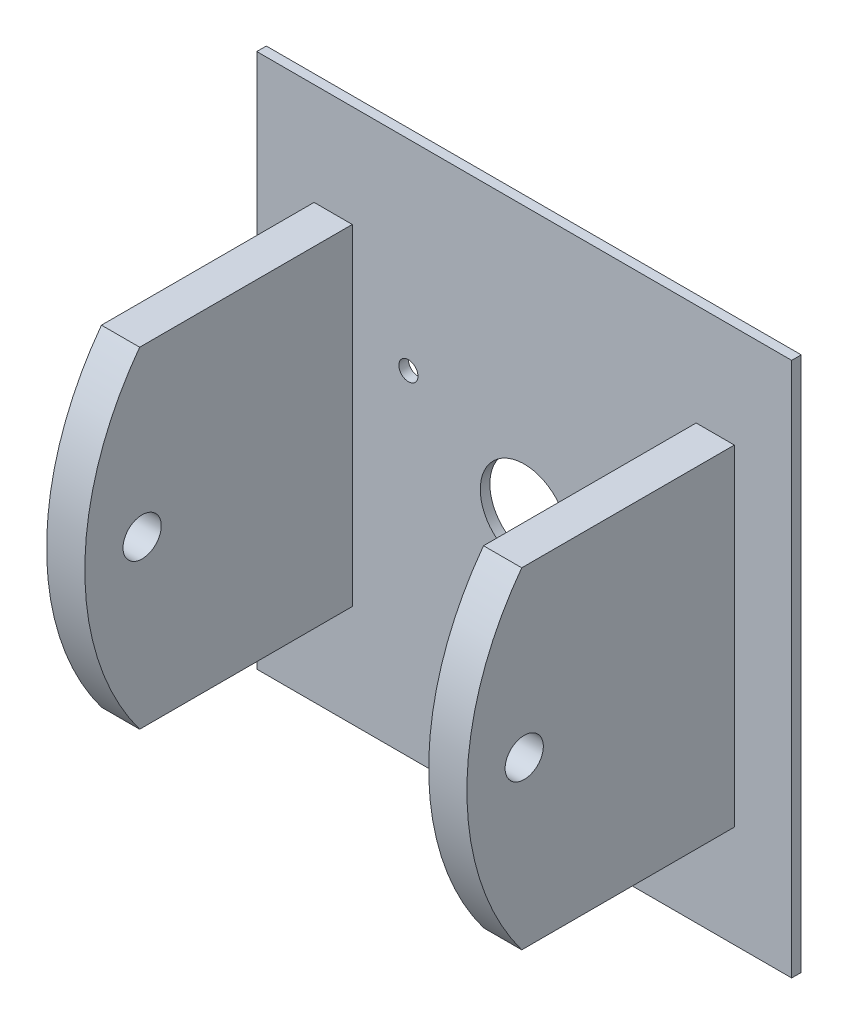
ISO-10303-21;
HEADER;
FILE_DESCRIPTION(('STEP AP214'),'2;1');
FILE_NAME('part.step','',(''),(''),'','','');
FILE_SCHEMA(('AUTOMOTIVE_DESIGN { 1 0 10303 214 1 1 1 1 }'));
ENDSEC;
DATA;
#1=APPLICATION_CONTEXT('core data for automotive mechanical design processes');
#2=APPLICATION_PROTOCOL_DEFINITION('international standard','automotive_design',2000,#1);
#3=PRODUCT_CONTEXT('',#1,'mechanical');
#4=PRODUCT('Part','Part','',(#3));
#5=PRODUCT_RELATED_PRODUCT_CATEGORY('part','',(#4));
#6=PRODUCT_DEFINITION_FORMATION('','',#4);
#7=PRODUCT_DEFINITION_CONTEXT('part definition',#1,'design');
#8=PRODUCT_DEFINITION('design','',#6,#7);
#9=PRODUCT_DEFINITION_SHAPE('','',#8);
#10=(LENGTH_UNIT() NAMED_UNIT(*) SI_UNIT(.MILLI.,.METRE.));
#11=(NAMED_UNIT(*) PLANE_ANGLE_UNIT() SI_UNIT($,.RADIAN.));
#12=(NAMED_UNIT(*) SI_UNIT($,.STERADIAN.) SOLID_ANGLE_UNIT());
#13=UNCERTAINTY_MEASURE_WITH_UNIT(LENGTH_MEASURE(1.E-05),#10,'distance_accuracy_value','');
#14=(GEOMETRIC_REPRESENTATION_CONTEXT(3) GLOBAL_UNCERTAINTY_ASSIGNED_CONTEXT((#13)) GLOBAL_UNIT_ASSIGNED_CONTEXT((#10,
#11,#12)) REPRESENTATION_CONTEXT('',''));
#15=CARTESIAN_POINT('',(0.,0.,0.));
#16=DIRECTION('',(0.,0.,1.));
#17=DIRECTION('',(1.,0.,0.));
#18=AXIS2_PLACEMENT_3D('',#15,#16,#17);
#19=CARTESIAN_POINT('',(-69.85,0.,92.075));
#20=DIRECTION('',(1.,0.,0.));
#21=DIRECTION('',(0.,0.,-1.));
#22=AXIS2_PLACEMENT_3D('',#19,#20,#21);
#23=PLANE('',#22);
#24=CARTESIAN_POINT('',(-69.85,0.,73.025));
#25=DIRECTION('',(-1.,0.,0.));
#26=DIRECTION('',(0.,0.,1.));
#27=AXIS2_PLACEMENT_3D('',#24,#25,#26);
#28=CIRCLE('',#27,6.35);
#29=CARTESIAN_POINT('',(-69.85,0.,79.375));
#30=VERTEX_POINT('',#29);
#31=EDGE_CURVE('E189',#30,#30,#28,.T.);
#32=ORIENTED_EDGE('',*,*,#31,.F.);
#33=EDGE_LOOP('',(#32));
#34=FACE_BOUND('',#33,.T.);
#35=DIRECTION('',(0.,0.,-1.));
#36=VECTOR('',#35,1.);
#37=CARTESIAN_POINT('',(-69.85,-54.9926131403118,92.075));
#38=LINE('',#37,#36);
#39=CARTESIAN_POINT('',(-69.85,-54.9926131403118,73.8486162700426));
#40=VERTEX_POINT('',#39);
#41=CARTESIAN_POINT('',(-69.85,-54.9926131403118,3.175));
#42=VERTEX_POINT('',#41);
#43=EDGE_CURVE('E185',#40,#42,#38,.T.);
#44=ORIENTED_EDGE('',*,*,#43,.F.);
#45=CARTESIAN_POINT('',(-69.85,0.,0.));
#46=DIRECTION('',(-1.,0.,0.));
#47=DIRECTION('',(0.,0.,1.));
#48=AXIS2_PLACEMENT_3D('',#45,#46,#47);
#49=CIRCLE('',#48,92.075);
#50=CARTESIAN_POINT('',(-69.85,54.9926131403118,73.8486162700426));
#51=VERTEX_POINT('',#50);
#52=EDGE_CURVE('E170',#40,#51,#49,.T.);
#53=ORIENTED_EDGE('',*,*,#52,.T.);
#54=DIRECTION('',(0.,0.,-1.));
#55=VECTOR('',#54,1.);
#56=CARTESIAN_POINT('',(-69.85,54.9926131403118,92.075));
#57=LINE('',#56,#55);
#58=CARTESIAN_POINT('',(-69.85,54.9926131403118,3.175));
#59=VERTEX_POINT('',#58);
#60=EDGE_CURVE('E512',#51,#59,#57,.T.);
#61=ORIENTED_EDGE('',*,*,#60,.T.);
#62=DIRECTION('',(0.,-1.,0.));
#63=VECTOR('',#62,1.);
#64=CARTESIAN_POINT('',(-69.85,0.,3.175));
#65=LINE('',#64,#63);
#66=EDGE_CURVE('E193',#59,#42,#65,.T.);
#67=ORIENTED_EDGE('',*,*,#66,.T.);
#68=EDGE_LOOP('',(#44,#53,#61,#67));
#69=FACE_BOUND('',#68,.T.);
#70=ADVANCED_FACE('F77',(#34,#69),#23,.F.);
#71=CARTESIAN_POINT('',(-57.15,0.,92.075));
#72=DIRECTION('',(1.,0.,0.));
#73=DIRECTION('',(0.,0.,-1.));
#74=AXIS2_PLACEMENT_3D('',#71,#72,#73);
#75=PLANE('',#74);
#76=CARTESIAN_POINT('',(-57.15,0.,73.025));
#77=DIRECTION('',(1.,0.,0.));
#78=DIRECTION('',(0.,0.,-1.));
#79=AXIS2_PLACEMENT_3D('',#76,#77,#78);
#80=CIRCLE('',#79,6.35);
#81=CARTESIAN_POINT('',(-57.15,0.,66.675));
#82=VERTEX_POINT('',#81);
#83=EDGE_CURVE('E180',#82,#82,#80,.T.);
#84=ORIENTED_EDGE('',*,*,#83,.F.);
#85=EDGE_LOOP('',(#84));
#86=FACE_BOUND('',#85,.T.);
#87=CARTESIAN_POINT('',(-57.15,0.,0.));
#88=DIRECTION('',(1.,0.,0.));
#89=DIRECTION('',(0.,0.,-1.));
#90=AXIS2_PLACEMENT_3D('',#87,#88,#89);
#91=CIRCLE('',#90,92.075);
#92=CARTESIAN_POINT('',(-57.1499999999999,54.9926131403118,73.8486162700426));
#93=VERTEX_POINT('',#92);
#94=CARTESIAN_POINT('',(-57.1499999999999,-54.9926131403118,73.8486162700426));
#95=VERTEX_POINT('',#94);
#96=EDGE_CURVE('E490',#93,#95,#91,.T.);
#97=ORIENTED_EDGE('',*,*,#96,.T.);
#98=DIRECTION('',(0.,0.,-1.));
#99=VECTOR('',#98,1.);
#100=CARTESIAN_POINT('',(-57.15,-54.9926131403118,92.075));
#101=LINE('',#100,#99);
#102=CARTESIAN_POINT('',(-57.15,-54.9926131403118,3.175));
#103=VERTEX_POINT('',#102);
#104=EDGE_CURVE('E187',#95,#103,#101,.T.);
#105=ORIENTED_EDGE('',*,*,#104,.T.);
#106=DIRECTION('',(0.,-1.,0.));
#107=VECTOR('',#106,1.);
#108=CARTESIAN_POINT('',(-57.15,0.,3.175));
#109=LINE('',#108,#107);
#110=CARTESIAN_POINT('',(-57.15,54.9926131403118,3.175));
#111=VERTEX_POINT('',#110);
#112=EDGE_CURVE('E506',#111,#103,#109,.T.);
#113=ORIENTED_EDGE('',*,*,#112,.F.);
#114=DIRECTION('',(0.,0.,-1.));
#115=VECTOR('',#114,1.);
#116=CARTESIAN_POINT('',(-57.15,54.9926131403118,92.075));
#117=LINE('',#116,#115);
#118=EDGE_CURVE('E199',#93,#111,#117,.T.);
#119=ORIENTED_EDGE('',*,*,#118,.F.);
#120=EDGE_LOOP('',(#97,#105,#113,#119));
#121=FACE_BOUND('',#120,.T.);
#122=ADVANCED_FACE('F278',(#86,#121),#75,.T.);
#123=CARTESIAN_POINT('',(69.85,-54.9926131403118,92.075));
#124=DIRECTION('',(-1.,0.,0.));
#125=DIRECTION('',(0.,0.,1.));
#126=AXIS2_PLACEMENT_3D('',#123,#124,#125);
#127=PLANE('',#126);
#128=CARTESIAN_POINT('',(69.85,0.,73.025));
#129=DIRECTION('',(-1.,0.,0.));
#130=DIRECTION('',(0.,0.,1.));
#131=AXIS2_PLACEMENT_3D('',#128,#129,#130);
#132=CIRCLE('',#131,6.35);
#133=CARTESIAN_POINT('',(69.85,0.,79.375));
#134=VERTEX_POINT('',#133);
#135=EDGE_CURVE('E530',#134,#134,#132,.T.);
#136=ORIENTED_EDGE('',*,*,#135,.T.);
#137=EDGE_LOOP('',(#136));
#138=FACE_BOUND('',#137,.T.);
#139=CARTESIAN_POINT('',(69.85,0.,0.));
#140=DIRECTION('',(-1.,0.,0.));
#141=DIRECTION('',(0.,0.,1.));
#142=AXIS2_PLACEMENT_3D('',#139,#140,#141);
#143=CIRCLE('',#142,92.075);
#144=CARTESIAN_POINT('',(69.85,-54.9926131403118,73.8486162700426));
#145=VERTEX_POINT('',#144);
#146=CARTESIAN_POINT('',(69.85,54.9926131403118,73.8486162700426));
#147=VERTEX_POINT('',#146);
#148=EDGE_CURVE('E484',#145,#147,#143,.T.);
#149=ORIENTED_EDGE('',*,*,#148,.F.);
#150=DIRECTION('',(0.,0.,-1.));
#151=VECTOR('',#150,1.);
#152=CARTESIAN_POINT('',(69.85,-54.9926131403118,92.075));
#153=LINE('',#152,#151);
#154=CARTESIAN_POINT('',(69.85,-54.9926131403118,3.175));
#155=VERTEX_POINT('',#154);
#156=EDGE_CURVE('E93',#145,#155,#153,.T.);
#157=ORIENTED_EDGE('',*,*,#156,.T.);
#158=DIRECTION('',(0.,1.,0.));
#159=VECTOR('',#158,1.);
#160=CARTESIAN_POINT('',(69.85,-54.9926131403118,3.175));
#161=LINE('',#160,#159);
#162=CARTESIAN_POINT('',(69.85,54.9926131403118,3.175));
#163=VERTEX_POINT('',#162);
#164=EDGE_CURVE('E486',#155,#163,#161,.T.);
#165=ORIENTED_EDGE('',*,*,#164,.T.);
#166=DIRECTION('',(0.,0.,-1.));
#167=VECTOR('',#166,1.);
#168=CARTESIAN_POINT('',(69.85,54.9926131403118,92.075));
#169=LINE('',#168,#167);
#170=EDGE_CURVE('E101',#147,#163,#169,.T.);
#171=ORIENTED_EDGE('',*,*,#170,.F.);
#172=EDGE_LOOP('',(#149,#157,#165,#171));
#173=FACE_BOUND('',#172,.T.);
#174=ADVANCED_FACE('F284',(#138,#173),#127,.F.);
#175=CARTESIAN_POINT('',(57.15,-54.9926131403118,92.075));
#176=DIRECTION('',(-1.,0.,0.));
#177=DIRECTION('',(0.,0.,1.));
#178=AXIS2_PLACEMENT_3D('',#175,#176,#177);
#179=PLANE('',#178);
#180=CARTESIAN_POINT('',(57.15,0.,73.025));
#181=DIRECTION('',(-1.,0.,0.));
#182=DIRECTION('',(0.,0.,1.));
#183=AXIS2_PLACEMENT_3D('',#180,#181,#182);
#184=CIRCLE('',#183,6.35);
#185=CARTESIAN_POINT('',(57.15,0.,79.375));
#186=VERTEX_POINT('',#185);
#187=EDGE_CURVE('E81',#186,#186,#184,.T.);
#188=ORIENTED_EDGE('',*,*,#187,.F.);
#189=EDGE_LOOP('',(#188));
#190=FACE_BOUND('',#189,.T.);
#191=DIRECTION('',(0.,0.,-1.));
#192=VECTOR('',#191,1.);
#193=CARTESIAN_POINT('',(57.15,-54.9926131403118,92.075));
#194=LINE('',#193,#192);
#195=CARTESIAN_POINT('',(57.15,-54.9926131403118,73.8486162700426));
#196=VERTEX_POINT('',#195);
#197=CARTESIAN_POINT('',(57.15,-54.9926131403118,3.175));
#198=VERTEX_POINT('',#197);
#199=EDGE_CURVE('E488',#196,#198,#194,.T.);
#200=ORIENTED_EDGE('',*,*,#199,.F.);
#201=CARTESIAN_POINT('',(57.15,0.,0.));
#202=DIRECTION('',(-1.,0.,0.));
#203=DIRECTION('',(0.,0.,1.));
#204=AXIS2_PLACEMENT_3D('',#201,#202,#203);
#205=CIRCLE('',#204,92.075);
#206=CARTESIAN_POINT('',(57.15,54.9926131403118,73.8486162700426));
#207=VERTEX_POINT('',#206);
#208=EDGE_CURVE('E482',#196,#207,#205,.T.);
#209=ORIENTED_EDGE('',*,*,#208,.T.);
#210=DIRECTION('',(0.,0.,-1.));
#211=VECTOR('',#210,1.);
#212=CARTESIAN_POINT('',(57.15,54.9926131403118,92.075));
#213=LINE('',#212,#211);
#214=CARTESIAN_POINT('',(57.15,54.9926131403118,3.175));
#215=VERTEX_POINT('',#214);
#216=EDGE_CURVE('E480',#207,#215,#213,.T.);
#217=ORIENTED_EDGE('',*,*,#216,.T.);
#218=DIRECTION('',(0.,1.,0.));
#219=VECTOR('',#218,1.);
#220=CARTESIAN_POINT('',(57.15,-54.9926131403118,3.175));
#221=LINE('',#220,#219);
#222=EDGE_CURVE('E497',#198,#215,#221,.T.);
#223=ORIENTED_EDGE('',*,*,#222,.F.);
#224=EDGE_LOOP('',(#200,#209,#217,#223));
#225=FACE_BOUND('',#224,.T.);
#226=ADVANCED_FACE('F396',(#190,#225),#179,.T.);
#227=CARTESIAN_POINT('',(0.,-54.9926131403118,92.075));
#228=DIRECTION('',(0.,1.,0.));
#229=DIRECTION('',(0.,0.,1.));
#230=AXIS2_PLACEMENT_3D('',#227,#228,#229);
#231=PLANE('',#230);
#232=DIRECTION('',(-1.,0.,0.));
#233=VECTOR('',#232,1.);
#234=CARTESIAN_POINT('',(88.9,-54.9926131403118,73.8486162700426));
#235=LINE('',#234,#233);
#236=EDGE_CURVE('E173',#95,#40,#235,.T.);
#237=ORIENTED_EDGE('',*,*,#236,.T.);
#238=ORIENTED_EDGE('',*,*,#43,.T.);
#239=DIRECTION('',(1.,0.,0.));
#240=VECTOR('',#239,1.);
#241=CARTESIAN_POINT('',(0.,-54.9926131403118,3.175));
#242=LINE('',#241,#240);
#243=EDGE_CURVE('E504',#42,#103,#242,.T.);
#244=ORIENTED_EDGE('',*,*,#243,.T.);
#245=ORIENTED_EDGE('',*,*,#104,.F.);
#246=EDGE_LOOP('',(#237,#238,#244,#245));
#247=FACE_BOUND('',#246,.T.);
#248=ADVANCED_FACE('F183',(#247),#231,.F.);
#249=CARTESIAN_POINT('',(69.85,-54.9926131403118,92.075));
#250=DIRECTION('',(0.,-1.,0.));
#251=DIRECTION('',(0.,0.,-1.));
#252=AXIS2_PLACEMENT_3D('',#249,#250,#251);
#253=PLANE('',#252);
#254=ORIENTED_EDGE('',*,*,#156,.F.);
#255=EDGE_CURVE('E188',#145,#196,#235,.T.);
#256=ORIENTED_EDGE('',*,*,#255,.T.);
#257=ORIENTED_EDGE('',*,*,#199,.T.);
#258=DIRECTION('',(-1.,0.,0.));
#259=VECTOR('',#258,1.);
#260=CARTESIAN_POINT('',(69.85,-54.9926131403118,3.175));
#261=LINE('',#260,#259);
#262=EDGE_CURVE('E500',#155,#198,#261,.T.);
#263=ORIENTED_EDGE('',*,*,#262,.F.);
#264=EDGE_LOOP('',(#254,#256,#257,#263));
#265=FACE_BOUND('',#264,.T.);
#266=ADVANCED_FACE('F413',(#265),#253,.T.);
#267=CARTESIAN_POINT('',(0.,54.9926131403118,92.075));
#268=DIRECTION('',(0.,1.,0.));
#269=DIRECTION('',(0.,0.,1.));
#270=AXIS2_PLACEMENT_3D('',#267,#268,#269);
#271=PLANE('',#270);
#272=ORIENTED_EDGE('',*,*,#60,.F.);
#273=DIRECTION('',(-1.,0.,0.));
#274=VECTOR('',#273,1.);
#275=CARTESIAN_POINT('',(88.9,54.9926131403118,73.8486162700426));
#276=LINE('',#275,#274);
#277=EDGE_CURVE('E176',#93,#51,#276,.T.);
#278=ORIENTED_EDGE('',*,*,#277,.F.);
#279=ORIENTED_EDGE('',*,*,#118,.T.);
#280=DIRECTION('',(1.,0.,0.));
#281=VECTOR('',#280,1.);
#282=CARTESIAN_POINT('',(0.,54.9926131403118,3.175));
#283=LINE('',#282,#281);
#284=EDGE_CURVE('E509',#59,#111,#283,.T.);
#285=ORIENTED_EDGE('',*,*,#284,.F.);
#286=EDGE_LOOP('',(#272,#278,#279,#285));
#287=FACE_BOUND('',#286,.T.);
#288=ADVANCED_FACE('F420',(#287),#271,.T.);
#289=CARTESIAN_POINT('',(69.85,54.9926131403118,92.075));
#290=DIRECTION('',(0.,-1.,0.));
#291=DIRECTION('',(0.,0.,-1.));
#292=AXIS2_PLACEMENT_3D('',#289,#290,#291);
#293=PLANE('',#292);
#294=EDGE_CURVE('E479',#147,#207,#276,.T.);
#295=ORIENTED_EDGE('',*,*,#294,.F.);
#296=ORIENTED_EDGE('',*,*,#170,.T.);
#297=DIRECTION('',(-1.,0.,0.));
#298=VECTOR('',#297,1.);
#299=CARTESIAN_POINT('',(69.85,54.9926131403118,3.175));
#300=LINE('',#299,#298);
#301=EDGE_CURVE('E495',#163,#215,#300,.T.);
#302=ORIENTED_EDGE('',*,*,#301,.T.);
#303=ORIENTED_EDGE('',*,*,#216,.F.);
#304=EDGE_LOOP('',(#295,#296,#302,#303));
#305=FACE_BOUND('',#304,.T.);
#306=ADVANCED_FACE('F309',(#305),#293,.F.);
#307=CARTESIAN_POINT('',(0.,0.,3.175));
#308=DIRECTION('',(0.,0.,1.));
#309=DIRECTION('',(1.,0.,0.));
#310=AXIS2_PLACEMENT_3D('',#307,#308,#309);
#311=PLANE('',#310);
#312=ORIENTED_EDGE('',*,*,#262,.T.);
#313=ORIENTED_EDGE('',*,*,#222,.T.);
#314=ORIENTED_EDGE('',*,*,#301,.F.);
#315=ORIENTED_EDGE('',*,*,#164,.F.);
#316=EDGE_LOOP('',(#312,#313,#314,#315));
#317=FACE_BOUND('',#316,.T.);
#318=ORIENTED_EDGE('',*,*,#66,.F.);
#319=ORIENTED_EDGE('',*,*,#284,.T.);
#320=ORIENTED_EDGE('',*,*,#112,.T.);
#321=ORIENTED_EDGE('',*,*,#243,.F.);
#322=EDGE_LOOP('',(#318,#319,#320,#321));
#323=FACE_BOUND('',#322,.T.);
#324=CARTESIAN_POINT('',(-38.4948291982183,22.225,3.175));
#325=DIRECTION('',(0.,0.,1.));
#326=DIRECTION('',(1.,0.,0.));
#327=AXIS2_PLACEMENT_3D('',#324,#325,#326);
#328=CIRCLE('',#327,3.175);
#329=CARTESIAN_POINT('',(-35.3198291982183,22.225,3.175));
#330=VERTEX_POINT('',#329);
#331=EDGE_CURVE('E207',#330,#330,#328,.T.);
#332=ORIENTED_EDGE('',*,*,#331,.F.);
#333=EDGE_LOOP('',(#332));
#334=FACE_BOUND('',#333,.T.);
#335=CARTESIAN_POINT('',(38.4948291982183,22.225,3.175));
#336=DIRECTION('',(0.,0.,1.));
#337=DIRECTION('',(1.,0.,0.));
#338=AXIS2_PLACEMENT_3D('',#335,#336,#337);
#339=CIRCLE('',#338,3.175);
#340=CARTESIAN_POINT('',(41.6698291982183,22.225,3.175));
#341=VERTEX_POINT('',#340);
#342=EDGE_CURVE('E213',#341,#341,#339,.T.);
#343=ORIENTED_EDGE('',*,*,#342,.F.);
#344=EDGE_LOOP('',(#343));
#345=FACE_BOUND('',#344,.T.);
#346=CARTESIAN_POINT('',(0.,-44.45,3.175));
#347=DIRECTION('',(0.,0.,1.));
#348=DIRECTION('',(1.,0.,0.));
#349=AXIS2_PLACEMENT_3D('',#346,#347,#348);
#350=CIRCLE('',#349,3.175);
#351=CARTESIAN_POINT('',(3.175,-44.45,3.175));
#352=VERTEX_POINT('',#351);
#353=EDGE_CURVE('E194',#352,#352,#350,.T.);
#354=ORIENTED_EDGE('',*,*,#353,.F.);
#355=EDGE_LOOP('',(#354));
#356=FACE_BOUND('',#355,.T.);
#357=DIRECTION('',(0.,1.,0.));
#358=VECTOR('',#357,1.);
#359=CARTESIAN_POINT('',(88.9,88.9,3.175));
#360=LINE('',#359,#358);
#361=CARTESIAN_POINT('',(88.9,-88.9,3.175));
#362=VERTEX_POINT('',#361);
#363=CARTESIAN_POINT('',(88.9,88.9,3.175));
#364=VERTEX_POINT('',#363);
#365=EDGE_CURVE('E224',#362,#364,#360,.T.);
#366=ORIENTED_EDGE('',*,*,#365,.T.);
#367=DIRECTION('',(-1.,0.,0.));
#368=VECTOR('',#367,1.);
#369=CARTESIAN_POINT('',(-88.9,88.9,3.175));
#370=LINE('',#369,#368);
#371=CARTESIAN_POINT('',(-88.9,88.9,3.175));
#372=VERTEX_POINT('',#371);
#373=EDGE_CURVE('E227',#364,#372,#370,.T.);
#374=ORIENTED_EDGE('',*,*,#373,.T.);
#375=DIRECTION('',(0.,-1.,0.));
#376=VECTOR('',#375,1.);
#377=CARTESIAN_POINT('',(-88.9,88.9,3.175));
#378=LINE('',#377,#376);
#379=CARTESIAN_POINT('',(-88.9,-88.9,3.175));
#380=VERTEX_POINT('',#379);
#381=EDGE_CURVE('E230',#372,#380,#378,.T.);
#382=ORIENTED_EDGE('',*,*,#381,.T.);
#383=DIRECTION('',(1.,0.,0.));
#384=VECTOR('',#383,1.);
#385=CARTESIAN_POINT('',(-88.9,-88.9,3.175));
#386=LINE('',#385,#384);
#387=EDGE_CURVE('E232',#380,#362,#386,.T.);
#388=ORIENTED_EDGE('',*,*,#387,.T.);
#389=EDGE_LOOP('',(#366,#374,#382,#388));
#390=FACE_BOUND('',#389,.T.);
#391=CARTESIAN_POINT('',(0.,0.,3.175));
#392=DIRECTION('',(0.,0.,1.));
#393=DIRECTION('',(1.,0.,0.));
#394=AXIS2_PLACEMENT_3D('',#391,#392,#393);
#395=CIRCLE('',#394,14.605);
#396=CARTESIAN_POINT('',(14.605,0.,3.175));
#397=VERTEX_POINT('',#396);
#398=EDGE_CURVE('E218',#397,#397,#395,.T.);
#399=ORIENTED_EDGE('',*,*,#398,.F.);
#400=EDGE_LOOP('',(#399));
#401=FACE_BOUND('',#400,.T.);
#402=ADVANCED_FACE('F268',(#317,#323,#334,#345,#356,#390,#401),#311,.T.);
#403=CARTESIAN_POINT('',(0.,0.,0.));
#404=DIRECTION('',(0.,0.,1.));
#405=DIRECTION('',(1.,0.,0.));
#406=AXIS2_PLACEMENT_3D('',#403,#404,#405);
#407=PLANE('',#406);
#408=CARTESIAN_POINT('',(-38.4948291982183,22.225,0.));
#409=DIRECTION('',(0.,0.,1.));
#410=DIRECTION('',(1.,0.,0.));
#411=AXIS2_PLACEMENT_3D('',#408,#409,#410);
#412=CIRCLE('',#411,3.175);
#413=CARTESIAN_POINT('',(-35.3198291982183,22.225,0.));
#414=VERTEX_POINT('',#413);
#415=EDGE_CURVE('E203',#414,#414,#412,.T.);
#416=ORIENTED_EDGE('',*,*,#415,.T.);
#417=EDGE_LOOP('',(#416));
#418=FACE_BOUND('',#417,.T.);
#419=CARTESIAN_POINT('',(38.4948291982183,22.225,0.));
#420=DIRECTION('',(0.,0.,1.));
#421=DIRECTION('',(1.,0.,0.));
#422=AXIS2_PLACEMENT_3D('',#419,#420,#421);
#423=CIRCLE('',#422,3.175);
#424=CARTESIAN_POINT('',(41.6698291982183,22.225,0.));
#425=VERTEX_POINT('',#424);
#426=EDGE_CURVE('E210',#425,#425,#423,.T.);
#427=ORIENTED_EDGE('',*,*,#426,.T.);
#428=EDGE_LOOP('',(#427));
#429=FACE_BOUND('',#428,.T.);
#430=CARTESIAN_POINT('',(0.,-44.45,0.));
#431=DIRECTION('',(0.,0.,1.));
#432=DIRECTION('',(1.,0.,0.));
#433=AXIS2_PLACEMENT_3D('',#430,#431,#432);
#434=CIRCLE('',#433,3.175);
#435=CARTESIAN_POINT('',(3.175,-44.45,0.));
#436=VERTEX_POINT('',#435);
#437=EDGE_CURVE('E197',#436,#436,#434,.T.);
#438=ORIENTED_EDGE('',*,*,#437,.T.);
#439=EDGE_LOOP('',(#438));
#440=FACE_BOUND('',#439,.T.);
#441=DIRECTION('',(0.,1.,0.));
#442=VECTOR('',#441,1.);
#443=CARTESIAN_POINT('',(88.9,88.9,0.));
#444=LINE('',#443,#442);
#445=CARTESIAN_POINT('',(88.9,-88.9,0.));
#446=VERTEX_POINT('',#445);
#447=CARTESIAN_POINT('',(88.9,88.9,0.));
#448=VERTEX_POINT('',#447);
#449=EDGE_CURVE('E221',#446,#448,#444,.T.);
#450=ORIENTED_EDGE('',*,*,#449,.F.);
#451=DIRECTION('',(1.,0.,0.));
#452=VECTOR('',#451,1.);
#453=CARTESIAN_POINT('',(-88.9,-88.9,0.));
#454=LINE('',#453,#452);
#455=CARTESIAN_POINT('',(-88.9,-88.9,0.));
#456=VERTEX_POINT('',#455);
#457=EDGE_CURVE('E228',#456,#446,#454,.T.);
#458=ORIENTED_EDGE('',*,*,#457,.F.);
#459=DIRECTION('',(0.,-1.,0.));
#460=VECTOR('',#459,1.);
#461=CARTESIAN_POINT('',(-88.9,88.9,0.));
#462=LINE('',#461,#460);
#463=CARTESIAN_POINT('',(-88.9,88.9,0.));
#464=VERTEX_POINT('',#463);
#465=EDGE_CURVE('E239',#464,#456,#462,.T.);
#466=ORIENTED_EDGE('',*,*,#465,.F.);
#467=DIRECTION('',(-1.,0.,0.));
#468=VECTOR('',#467,1.);
#469=CARTESIAN_POINT('',(-88.9,88.9,0.));
#470=LINE('',#469,#468);
#471=EDGE_CURVE('E237',#448,#464,#470,.T.);
#472=ORIENTED_EDGE('',*,*,#471,.F.);
#473=EDGE_LOOP('',(#450,#458,#466,#472));
#474=FACE_BOUND('',#473,.T.);
#475=CARTESIAN_POINT('',(0.,0.,0.));
#476=DIRECTION('',(0.,0.,1.));
#477=DIRECTION('',(1.,0.,0.));
#478=AXIS2_PLACEMENT_3D('',#475,#476,#477);
#479=CIRCLE('',#478,14.605);
#480=CARTESIAN_POINT('',(14.605,0.,0.));
#481=VERTEX_POINT('',#480);
#482=EDGE_CURVE('E206',#481,#481,#479,.T.);
#483=ORIENTED_EDGE('',*,*,#482,.T.);
#484=EDGE_LOOP('',(#483));
#485=FACE_BOUND('',#484,.T.);
#486=ADVANCED_FACE('F258',(#418,#429,#440,#474,#485),#407,.F.);
#487=CARTESIAN_POINT('',(88.9,88.9,3.175));
#488=DIRECTION('',(-1.,0.,0.));
#489=DIRECTION('',(0.,-1.,0.));
#490=AXIS2_PLACEMENT_3D('',#487,#488,#489);
#491=PLANE('',#490);
#492=ORIENTED_EDGE('',*,*,#449,.T.);
#493=DIRECTION('',(0.,0.,-1.));
#494=VECTOR('',#493,1.);
#495=CARTESIAN_POINT('',(88.9,88.9,3.175));
#496=LINE('',#495,#494);
#497=EDGE_CURVE('E12',#364,#448,#496,.T.);
#498=ORIENTED_EDGE('',*,*,#497,.F.);
#499=ORIENTED_EDGE('',*,*,#365,.F.);
#500=DIRECTION('',(0.,0.,-1.));
#501=VECTOR('',#500,1.);
#502=CARTESIAN_POINT('',(88.9,-88.9,3.175));
#503=LINE('',#502,#501);
#504=EDGE_CURVE('E234',#362,#446,#503,.T.);
#505=ORIENTED_EDGE('',*,*,#504,.T.);
#506=EDGE_LOOP('',(#492,#498,#499,#505));
#507=FACE_BOUND('',#506,.T.);
#508=ADVANCED_FACE('F79',(#507),#491,.F.);
#509=CARTESIAN_POINT('',(-88.9,88.9,3.175));
#510=DIRECTION('',(0.,-1.,0.));
#511=DIRECTION('',(0.,0.,-1.));
#512=AXIS2_PLACEMENT_3D('',#509,#510,#511);
#513=PLANE('',#512);
#514=ORIENTED_EDGE('',*,*,#471,.T.);
#515=DIRECTION('',(0.,0.,-1.));
#516=VECTOR('',#515,1.);
#517=CARTESIAN_POINT('',(-88.9,88.9,3.175));
#518=LINE('',#517,#516);
#519=EDGE_CURVE('E86',#372,#464,#518,.T.);
#520=ORIENTED_EDGE('',*,*,#519,.F.);
#521=ORIENTED_EDGE('',*,*,#373,.F.);
#522=ORIENTED_EDGE('',*,*,#497,.T.);
#523=EDGE_LOOP('',(#514,#520,#521,#522));
#524=FACE_BOUND('',#523,.T.);
#525=ADVANCED_FACE('F270',(#524),#513,.F.);
#526=CARTESIAN_POINT('',(-88.9,88.9,3.175));
#527=DIRECTION('',(1.,0.,0.));
#528=DIRECTION('',(0.,1.,0.));
#529=AXIS2_PLACEMENT_3D('',#526,#527,#528);
#530=PLANE('',#529);
#531=ORIENTED_EDGE('',*,*,#465,.T.);
#532=DIRECTION('',(0.,0.,-1.));
#533=VECTOR('',#532,1.);
#534=CARTESIAN_POINT('',(-88.9,-88.9,3.175));
#535=LINE('',#534,#533);
#536=EDGE_CURVE('E244',#380,#456,#535,.T.);
#537=ORIENTED_EDGE('',*,*,#536,.F.);
#538=ORIENTED_EDGE('',*,*,#381,.F.);
#539=ORIENTED_EDGE('',*,*,#519,.T.);
#540=EDGE_LOOP('',(#531,#537,#538,#539));
#541=FACE_BOUND('',#540,.T.);
#542=ADVANCED_FACE('F252',(#541),#530,.F.);
#543=CARTESIAN_POINT('',(-88.9,-88.9,3.175));
#544=DIRECTION('',(0.,1.,0.));
#545=DIRECTION('',(0.,0.,1.));
#546=AXIS2_PLACEMENT_3D('',#543,#544,#545);
#547=PLANE('',#546);
#548=ORIENTED_EDGE('',*,*,#457,.T.);
#549=ORIENTED_EDGE('',*,*,#504,.F.);
#550=ORIENTED_EDGE('',*,*,#387,.F.);
#551=ORIENTED_EDGE('',*,*,#536,.T.);
#552=EDGE_LOOP('',(#548,#549,#550,#551));
#553=FACE_BOUND('',#552,.T.);
#554=ADVANCED_FACE('F262',(#553),#547,.F.);
#555=CARTESIAN_POINT('',(0.,0.,3.175));
#556=DIRECTION('',(0.,0.,-1.));
#557=DIRECTION('',(-1.,0.,0.));
#558=AXIS2_PLACEMENT_3D('',#555,#556,#557);
#559=CYLINDRICAL_SURFACE('',#558,14.605);
#560=ORIENTED_EDGE('',*,*,#398,.T.);
#561=EDGE_LOOP('',(#560));
#562=FACE_BOUND('',#561,.T.);
#563=ORIENTED_EDGE('',*,*,#482,.F.);
#564=EDGE_LOOP('',(#563));
#565=FACE_BOUND('',#564,.T.);
#566=ADVANCED_FACE('F302',(#562,#565),#559,.F.);
#567=CARTESIAN_POINT('',(0.,-44.45,0.));
#568=DIRECTION('',(0.,0.,1.));
#569=DIRECTION('',(1.,0.,0.));
#570=AXIS2_PLACEMENT_3D('',#567,#568,#569);
#571=CYLINDRICAL_SURFACE('',#570,3.175);
#572=ORIENTED_EDGE('',*,*,#437,.F.);
#573=EDGE_LOOP('',(#572));
#574=FACE_BOUND('',#573,.T.);
#575=ORIENTED_EDGE('',*,*,#353,.T.);
#576=EDGE_LOOP('',(#575));
#577=FACE_BOUND('',#576,.T.);
#578=ADVANCED_FACE('F298',(#574,#577),#571,.F.);
#579=CARTESIAN_POINT('',(38.4948291982183,22.225,0.));
#580=DIRECTION('',(0.,0.,1.));
#581=DIRECTION('',(1.,0.,0.));
#582=AXIS2_PLACEMENT_3D('',#579,#580,#581);
#583=CYLINDRICAL_SURFACE('',#582,3.175);
#584=ORIENTED_EDGE('',*,*,#426,.F.);
#585=EDGE_LOOP('',(#584));
#586=FACE_BOUND('',#585,.T.);
#587=ORIENTED_EDGE('',*,*,#342,.T.);
#588=EDGE_LOOP('',(#587));
#589=FACE_BOUND('',#588,.T.);
#590=ADVANCED_FACE('F294',(#586,#589),#583,.F.);
#591=CARTESIAN_POINT('',(-38.4948291982183,22.225,0.));
#592=DIRECTION('',(0.,0.,1.));
#593=DIRECTION('',(1.,0.,0.));
#594=AXIS2_PLACEMENT_3D('',#591,#592,#593);
#595=CYLINDRICAL_SURFACE('',#594,3.175);
#596=ORIENTED_EDGE('',*,*,#415,.F.);
#597=EDGE_LOOP('',(#596));
#598=FACE_BOUND('',#597,.T.);
#599=ORIENTED_EDGE('',*,*,#331,.T.);
#600=EDGE_LOOP('',(#599));
#601=FACE_BOUND('',#600,.T.);
#602=ADVANCED_FACE('F290',(#598,#601),#595,.F.);
#603=CARTESIAN_POINT('',(88.9,0.,0.));
#604=DIRECTION('',(-1.,0.,0.));
#605=DIRECTION('',(0.,0.,1.));
#606=AXIS2_PLACEMENT_3D('',#603,#604,#605);
#607=CYLINDRICAL_SURFACE('',#606,92.075);
#608=ORIENTED_EDGE('',*,*,#148,.T.);
#609=ORIENTED_EDGE('',*,*,#294,.T.);
#610=ORIENTED_EDGE('',*,*,#208,.F.);
#611=ORIENTED_EDGE('',*,*,#255,.F.);
#612=EDGE_LOOP('',(#608,#609,#610,#611));
#613=FACE_BOUND('',#612,.T.);
#614=ADVANCED_FACE('F293',(#613),#607,.T.);
#615=ORIENTED_EDGE('',*,*,#277,.T.);
#616=ORIENTED_EDGE('',*,*,#52,.F.);
#617=ORIENTED_EDGE('',*,*,#236,.F.);
#618=ORIENTED_EDGE('',*,*,#96,.F.);
#619=EDGE_LOOP('',(#615,#616,#617,#618));
#620=FACE_BOUND('',#619,.T.);
#621=ADVANCED_FACE('F172',(#620),#607,.T.);
#622=CARTESIAN_POINT('',(88.9,0.,73.025));
#623=DIRECTION('',(-1.,0.,0.));
#624=DIRECTION('',(0.,0.,1.));
#625=AXIS2_PLACEMENT_3D('',#622,#623,#624);
#626=CYLINDRICAL_SURFACE('',#625,6.35);
#627=ORIENTED_EDGE('',*,*,#187,.T.);
#628=EDGE_LOOP('',(#627));
#629=FACE_BOUND('',#628,.T.);
#630=ORIENTED_EDGE('',*,*,#135,.F.);
#631=EDGE_LOOP('',(#630));
#632=FACE_BOUND('',#631,.T.);
#633=ADVANCED_FACE('F351',(#629,#632),#626,.F.);
#634=ORIENTED_EDGE('',*,*,#83,.T.);
#635=EDGE_LOOP('',(#634));
#636=FACE_BOUND('',#635,.T.);
#637=ORIENTED_EDGE('',*,*,#31,.T.);
#638=EDGE_LOOP('',(#637));
#639=FACE_BOUND('',#638,.T.);
#640=ADVANCED_FACE('F357',(#636,#639),#626,.F.);
#641=CLOSED_SHELL('',(#70,#122,#174,#226,#248,#266,#288,#306,#402,#486,#508,#525,#542,#554,#566,
#578,#590,#602,#614,#621,#633,#640));
#642=MANIFOLD_SOLID_BREP('B2',#641);
#643=ADVANCED_BREP_SHAPE_REPRESENTATION('',(#18,#642),#14);
#644=SHAPE_DEFINITION_REPRESENTATION(#9,#643);
ENDSEC;
END-ISO-10303-21;
